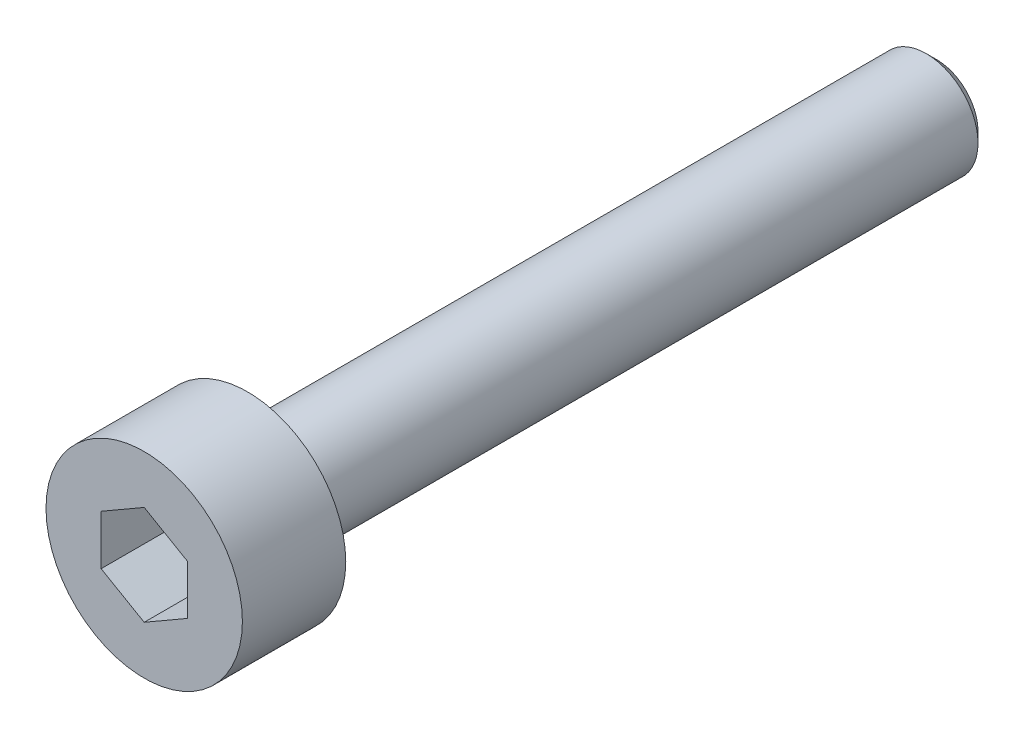
ISO-10303-21;
HEADER;
FILE_DESCRIPTION(('STEP AP214'),'2;1');
FILE_NAME('part.step','',(''),(''),'','','');
FILE_SCHEMA(('AUTOMOTIVE_DESIGN { 1 0 10303 214 1 1 1 1 }'));
ENDSEC;
DATA;
#1=APPLICATION_CONTEXT('core data for automotive mechanical design processes');
#2=APPLICATION_PROTOCOL_DEFINITION('international standard','automotive_design',2000,#1);
#3=PRODUCT_CONTEXT('',#1,'mechanical');
#4=PRODUCT('Part','Part','',(#3));
#5=PRODUCT_RELATED_PRODUCT_CATEGORY('part','',(#4));
#6=PRODUCT_DEFINITION_FORMATION('','',#4);
#7=PRODUCT_DEFINITION_CONTEXT('part definition',#1,'design');
#8=PRODUCT_DEFINITION('design','',#6,#7);
#9=PRODUCT_DEFINITION_SHAPE('','',#8);
#10=(LENGTH_UNIT() NAMED_UNIT(*) SI_UNIT(.MILLI.,.METRE.));
#11=(NAMED_UNIT(*) PLANE_ANGLE_UNIT() SI_UNIT($,.RADIAN.));
#12=(NAMED_UNIT(*) SI_UNIT($,.STERADIAN.) SOLID_ANGLE_UNIT());
#13=UNCERTAINTY_MEASURE_WITH_UNIT(LENGTH_MEASURE(1.E-05),#10,'distance_accuracy_value','');
#14=(GEOMETRIC_REPRESENTATION_CONTEXT(3) GLOBAL_UNCERTAINTY_ASSIGNED_CONTEXT((#13)) GLOBAL_UNIT_ASSIGNED_CONTEXT((#10,
#11,#12)) REPRESENTATION_CONTEXT('',''));
#15=CARTESIAN_POINT('',(0.,0.,0.));
#16=DIRECTION('',(0.,0.,1.));
#17=DIRECTION('',(1.,0.,0.));
#18=AXIS2_PLACEMENT_3D('',#15,#16,#17);
#19=CARTESIAN_POINT('',(0.,0.,0.));
#20=DIRECTION('',(0.,0.,1.));
#21=DIRECTION('',(1.,0.,0.));
#22=AXIS2_PLACEMENT_3D('',#19,#20,#21);
#23=PLANE('',#22);
#24=CARTESIAN_POINT('',(0.,0.,0.));
#25=DIRECTION('',(0.,0.,1.));
#26=DIRECTION('',(1.,0.,0.));
#27=AXIS2_PLACEMENT_3D('',#24,#25,#26);
#28=CIRCLE('',#27,2.85);
#29=CARTESIAN_POINT('',(2.85,0.,0.));
#30=VERTEX_POINT('',#29);
#31=EDGE_CURVE('E136',#30,#30,#28,.T.);
#32=ORIENTED_EDGE('',*,*,#31,.F.);
#33=EDGE_LOOP('',(#32));
#34=FACE_BOUND('',#33,.T.);
#35=CARTESIAN_POINT('',(0.,0.,0.));
#36=DIRECTION('',(0.,0.,1.));
#37=DIRECTION('',(1.,0.,0.));
#38=AXIS2_PLACEMENT_3D('',#35,#36,#37);
#39=CIRCLE('',#38,1.5);
#40=CARTESIAN_POINT('',(1.5,0.,0.));
#41=VERTEX_POINT('',#40);
#42=EDGE_CURVE('E145',#41,#41,#39,.F.);
#43=ORIENTED_EDGE('',*,*,#42,.F.);
#44=EDGE_LOOP('',(#43));
#45=FACE_BOUND('',#44,.T.);
#46=ADVANCED_FACE('F34',(#34,#45),#23,.F.);
#47=CARTESIAN_POINT('',(0.,0.,3.));
#48=DIRECTION('',(0.,0.,-1.));
#49=DIRECTION('',(-1.,0.,0.));
#50=AXIS2_PLACEMENT_3D('',#47,#48,#49);
#51=CYLINDRICAL_SURFACE('',#50,2.85);
#52=CARTESIAN_POINT('',(0.,0.,3.));
#53=DIRECTION('',(0.,0.,1.));
#54=DIRECTION('',(1.,0.,0.));
#55=AXIS2_PLACEMENT_3D('',#52,#53,#54);
#56=CIRCLE('',#55,2.85);
#57=CARTESIAN_POINT('',(2.85,0.,3.));
#58=VERTEX_POINT('',#57);
#59=EDGE_CURVE('E142',#58,#58,#56,.T.);
#60=ORIENTED_EDGE('',*,*,#59,.F.);
#61=EDGE_LOOP('',(#60));
#62=FACE_BOUND('',#61,.T.);
#63=ORIENTED_EDGE('',*,*,#31,.T.);
#64=EDGE_LOOP('',(#63));
#65=FACE_BOUND('',#64,.T.);
#66=ADVANCED_FACE('F167',(#62,#65),#51,.T.);
#67=CARTESIAN_POINT('',(0.,0.,3.));
#68=DIRECTION('',(0.,0.,1.));
#69=DIRECTION('',(1.,0.,0.));
#70=AXIS2_PLACEMENT_3D('',#67,#68,#69);
#71=PLANE('',#70);
#72=DIRECTION('',(-0.866025403784439,0.5,0.));
#73=VECTOR('',#72,1.);
#74=CARTESIAN_POINT('',(1.25,0.721687836487032,3.));
#75=LINE('',#74,#73);
#76=CARTESIAN_POINT('',(1.25,0.721687836487032,3.));
#77=VERTEX_POINT('',#76);
#78=CARTESIAN_POINT('',(0.,1.44337567297406,3.));
#79=VERTEX_POINT('',#78);
#80=EDGE_CURVE('E49',#77,#79,#75,.T.);
#81=ORIENTED_EDGE('',*,*,#80,.F.);
#82=DIRECTION('',(0.,1.,0.));
#83=VECTOR('',#82,1.);
#84=CARTESIAN_POINT('',(1.25,-0.721687836487032,3.));
#85=LINE('',#84,#83);
#86=CARTESIAN_POINT('',(1.25,-0.721687836487032,3.));
#87=VERTEX_POINT('',#86);
#88=EDGE_CURVE('E132',#87,#77,#85,.T.);
#89=ORIENTED_EDGE('',*,*,#88,.F.);
#90=DIRECTION('',(0.866025403784439,0.5,0.));
#91=VECTOR('',#90,1.);
#92=CARTESIAN_POINT('',(0.,-1.44337567297406,3.));
#93=LINE('',#92,#91);
#94=CARTESIAN_POINT('',(0.,-1.44337567297406,3.));
#95=VERTEX_POINT('',#94);
#96=EDGE_CURVE('E130',#95,#87,#93,.T.);
#97=ORIENTED_EDGE('',*,*,#96,.F.);
#98=DIRECTION('',(0.866025403784439,-0.5,0.));
#99=VECTOR('',#98,1.);
#100=CARTESIAN_POINT('',(-1.25,-0.721687836487033,3.));
#101=LINE('',#100,#99);
#102=CARTESIAN_POINT('',(-1.25,-0.721687836487033,3.));
#103=VERTEX_POINT('',#102);
#104=EDGE_CURVE('E97',#103,#95,#101,.T.);
#105=ORIENTED_EDGE('',*,*,#104,.F.);
#106=DIRECTION('',(0.,-1.,0.));
#107=VECTOR('',#106,1.);
#108=CARTESIAN_POINT('',(-1.25,0.721687836487032,3.));
#109=LINE('',#108,#107);
#110=CARTESIAN_POINT('',(-1.25,0.721687836487032,3.));
#111=VERTEX_POINT('',#110);
#112=EDGE_CURVE('E126',#111,#103,#109,.T.);
#113=ORIENTED_EDGE('',*,*,#112,.F.);
#114=DIRECTION('',(-0.866025403784439,-0.5,0.));
#115=VECTOR('',#114,1.);
#116=CARTESIAN_POINT('',(0.,1.44337567297406,3.));
#117=LINE('',#116,#115);
#118=EDGE_CURVE('E123',#79,#111,#117,.T.);
#119=ORIENTED_EDGE('',*,*,#118,.F.);
#120=EDGE_LOOP('',(#81,#89,#97,#105,#113,#119));
#121=FACE_BOUND('',#120,.T.);
#122=ORIENTED_EDGE('',*,*,#59,.T.);
#123=EDGE_LOOP('',(#122));
#124=FACE_BOUND('',#123,.T.);
#125=ADVANCED_FACE('F173',(#121,#124),#71,.T.);
#126=CARTESIAN_POINT('',(0.,0.,-20.));
#127=DIRECTION('',(0.,0.,1.));
#128=DIRECTION('',(1.,0.,0.));
#129=AXIS2_PLACEMENT_3D('',#126,#127,#128);
#130=CYLINDRICAL_SURFACE('',#129,1.5);
#131=CARTESIAN_POINT('',(0.,0.,-19.7));
#132=DIRECTION('',(0.,0.,-1.));
#133=DIRECTION('',(-1.,0.,0.));
#134=AXIS2_PLACEMENT_3D('',#131,#132,#133);
#135=CIRCLE('',#134,1.5);
#136=CARTESIAN_POINT('',(-1.5,0.,-19.7));
#137=VERTEX_POINT('',#136);
#138=EDGE_CURVE('E11',#137,#137,#135,.F.);
#139=ORIENTED_EDGE('',*,*,#138,.T.);
#140=EDGE_LOOP('',(#139));
#141=FACE_BOUND('',#140,.T.);
#142=ORIENTED_EDGE('',*,*,#42,.T.);
#143=EDGE_LOOP('',(#142));
#144=FACE_BOUND('',#143,.T.);
#145=ADVANCED_FACE('F163',(#141,#144),#130,.T.);
#146=CARTESIAN_POINT('',(0.,0.,-20.));
#147=DIRECTION('',(0.,0.,-1.));
#148=DIRECTION('',(-1.,0.,0.));
#149=AXIS2_PLACEMENT_3D('',#146,#147,#148);
#150=PLANE('',#149);
#151=CARTESIAN_POINT('',(0.,0.,-20.));
#152=DIRECTION('',(0.,0.,-1.));
#153=DIRECTION('',(-1.,0.,0.));
#154=AXIS2_PLACEMENT_3D('',#151,#152,#153);
#155=CIRCLE('',#154,1.2);
#156=CARTESIAN_POINT('',(-1.2,0.,-20.));
#157=VERTEX_POINT('',#156);
#158=EDGE_CURVE('E42',#157,#157,#155,.T.);
#159=ORIENTED_EDGE('',*,*,#158,.T.);
#160=EDGE_LOOP('',(#159));
#161=FACE_BOUND('',#160,.T.);
#162=ADVANCED_FACE('F152',(#161),#150,.T.);
#163=CARTESIAN_POINT('',(0.,0.,-20.));
#164=DIRECTION('',(0.,0.,1.));
#165=DIRECTION('',(1.,0.,0.));
#166=AXIS2_PLACEMENT_3D('',#163,#164,#165);
#167=CONICAL_SURFACE('',#166,1.2,0.785398163397447);
#168=ORIENTED_EDGE('',*,*,#138,.F.);
#169=EDGE_LOOP('',(#168));
#170=FACE_BOUND('',#169,.T.);
#171=ORIENTED_EDGE('',*,*,#158,.F.);
#172=EDGE_LOOP('',(#171));
#173=FACE_BOUND('',#172,.T.);
#174=ADVANCED_FACE('F36',(#170,#173),#167,.T.);
#175=CARTESIAN_POINT('',(1.25,0.721687836487032,1.));
#176=DIRECTION('',(0.5,0.866025403784439,0.));
#177=DIRECTION('',(-0.866025403784439,0.5,0.));
#178=AXIS2_PLACEMENT_3D('',#175,#176,#177);
#179=PLANE('',#178);
#180=ORIENTED_EDGE('',*,*,#80,.T.);
#181=DIRECTION('',(0.,0.,1.));
#182=VECTOR('',#181,1.);
#183=CARTESIAN_POINT('',(0.,1.44337567297406,1.));
#184=LINE('',#183,#182);
#185=CARTESIAN_POINT('',(0.,1.44337567297406,1.));
#186=VERTEX_POINT('',#185);
#187=EDGE_CURVE('E79',#186,#79,#184,.T.);
#188=ORIENTED_EDGE('',*,*,#187,.F.);
#189=DIRECTION('',(-0.866025403784439,0.5,0.));
#190=VECTOR('',#189,1.);
#191=CARTESIAN_POINT('',(1.25,0.721687836487032,1.));
#192=LINE('',#191,#190);
#193=CARTESIAN_POINT('',(1.25,0.721687836487032,1.));
#194=VERTEX_POINT('',#193);
#195=EDGE_CURVE('E134',#194,#186,#192,.T.);
#196=ORIENTED_EDGE('',*,*,#195,.F.);
#197=DIRECTION('',(0.,0.,1.));
#198=VECTOR('',#197,1.);
#199=CARTESIAN_POINT('',(1.25,0.721687836487032,1.));
#200=LINE('',#199,#198);
#201=EDGE_CURVE('E57',#194,#77,#200,.T.);
#202=ORIENTED_EDGE('',*,*,#201,.T.);
#203=EDGE_LOOP('',(#180,#188,#196,#202));
#204=FACE_BOUND('',#203,.T.);
#205=ADVANCED_FACE('F155',(#204),#179,.F.);
#206=CARTESIAN_POINT('',(1.25,-0.721687836487032,1.));
#207=DIRECTION('',(1.,0.,0.));
#208=DIRECTION('',(0.,1.,0.));
#209=AXIS2_PLACEMENT_3D('',#206,#207,#208);
#210=PLANE('',#209);
#211=ORIENTED_EDGE('',*,*,#88,.T.);
#212=ORIENTED_EDGE('',*,*,#201,.F.);
#213=DIRECTION('',(0.,1.,0.));
#214=VECTOR('',#213,1.);
#215=CARTESIAN_POINT('',(1.25,-0.721687836487032,1.));
#216=LINE('',#215,#214);
#217=CARTESIAN_POINT('',(1.25,-0.721687836487032,1.));
#218=VERTEX_POINT('',#217);
#219=EDGE_CURVE('E109',#218,#194,#216,.T.);
#220=ORIENTED_EDGE('',*,*,#219,.F.);
#221=DIRECTION('',(0.,0.,1.));
#222=VECTOR('',#221,1.);
#223=CARTESIAN_POINT('',(1.25,-0.721687836487032,1.));
#224=LINE('',#223,#222);
#225=EDGE_CURVE('E101',#218,#87,#224,.T.);
#226=ORIENTED_EDGE('',*,*,#225,.T.);
#227=EDGE_LOOP('',(#211,#212,#220,#226));
#228=FACE_BOUND('',#227,.T.);
#229=ADVANCED_FACE('F161',(#228),#210,.F.);
#230=CARTESIAN_POINT('',(0.,-1.44337567297406,1.));
#231=DIRECTION('',(0.5,-0.866025403784439,0.));
#232=DIRECTION('',(0.866025403784439,0.5,0.));
#233=AXIS2_PLACEMENT_3D('',#230,#231,#232);
#234=PLANE('',#233);
#235=ORIENTED_EDGE('',*,*,#96,.T.);
#236=ORIENTED_EDGE('',*,*,#225,.F.);
#237=DIRECTION('',(0.866025403784439,0.5,0.));
#238=VECTOR('',#237,1.);
#239=CARTESIAN_POINT('',(0.,-1.44337567297406,1.));
#240=LINE('',#239,#238);
#241=CARTESIAN_POINT('',(0.,-1.44337567297406,1.));
#242=VERTEX_POINT('',#241);
#243=EDGE_CURVE('E105',#242,#218,#240,.T.);
#244=ORIENTED_EDGE('',*,*,#243,.F.);
#245=DIRECTION('',(0.,0.,1.));
#246=VECTOR('',#245,1.);
#247=CARTESIAN_POINT('',(0.,-1.44337567297406,1.));
#248=LINE('',#247,#246);
#249=EDGE_CURVE('E90',#242,#95,#248,.T.);
#250=ORIENTED_EDGE('',*,*,#249,.T.);
#251=EDGE_LOOP('',(#235,#236,#244,#250));
#252=FACE_BOUND('',#251,.T.);
#253=ADVANCED_FACE('F106',(#252),#234,.F.);
#254=CARTESIAN_POINT('',(-1.25,-0.721687836487033,1.));
#255=DIRECTION('',(-0.5,-0.866025403784439,0.));
#256=DIRECTION('',(0.866025403784439,-0.5,0.));
#257=AXIS2_PLACEMENT_3D('',#254,#255,#256);
#258=PLANE('',#257);
#259=ORIENTED_EDGE('',*,*,#104,.T.);
#260=ORIENTED_EDGE('',*,*,#249,.F.);
#261=DIRECTION('',(0.866025403784439,-0.5,0.));
#262=VECTOR('',#261,1.);
#263=CARTESIAN_POINT('',(-1.25,-0.721687836487033,1.));
#264=LINE('',#263,#262);
#265=CARTESIAN_POINT('',(-1.25,-0.721687836487033,1.));
#266=VERTEX_POINT('',#265);
#267=EDGE_CURVE('E94',#266,#242,#264,.T.);
#268=ORIENTED_EDGE('',*,*,#267,.F.);
#269=DIRECTION('',(0.,0.,1.));
#270=VECTOR('',#269,1.);
#271=CARTESIAN_POINT('',(-1.25,-0.721687836487033,1.));
#272=LINE('',#271,#270);
#273=EDGE_CURVE('E102',#266,#103,#272,.T.);
#274=ORIENTED_EDGE('',*,*,#273,.T.);
#275=EDGE_LOOP('',(#259,#260,#268,#274));
#276=FACE_BOUND('',#275,.T.);
#277=ADVANCED_FACE('F92',(#276),#258,.F.);
#278=CARTESIAN_POINT('',(-1.25,0.721687836487032,1.));
#279=DIRECTION('',(-1.,0.,0.));
#280=DIRECTION('',(0.,0.,1.));
#281=AXIS2_PLACEMENT_3D('',#278,#279,#280);
#282=PLANE('',#281);
#283=ORIENTED_EDGE('',*,*,#112,.T.);
#284=ORIENTED_EDGE('',*,*,#273,.F.);
#285=DIRECTION('',(0.,-1.,0.));
#286=VECTOR('',#285,1.);
#287=CARTESIAN_POINT('',(-1.25,0.721687836487032,1.));
#288=LINE('',#287,#286);
#289=CARTESIAN_POINT('',(-1.25,0.721687836487032,1.));
#290=VERTEX_POINT('',#289);
#291=EDGE_CURVE('E115',#290,#266,#288,.T.);
#292=ORIENTED_EDGE('',*,*,#291,.F.);
#293=DIRECTION('',(0.,0.,1.));
#294=VECTOR('',#293,1.);
#295=CARTESIAN_POINT('',(-1.25,0.721687836487032,1.));
#296=LINE('',#295,#294);
#297=EDGE_CURVE('E139',#290,#111,#296,.T.);
#298=ORIENTED_EDGE('',*,*,#297,.T.);
#299=EDGE_LOOP('',(#283,#284,#292,#298));
#300=FACE_BOUND('',#299,.T.);
#301=ADVANCED_FACE('F187',(#300),#282,.F.);
#302=CARTESIAN_POINT('',(0.,1.44337567297406,1.));
#303=DIRECTION('',(-0.5,0.866025403784439,0.));
#304=DIRECTION('',(-0.866025403784439,-0.5,0.));
#305=AXIS2_PLACEMENT_3D('',#302,#303,#304);
#306=PLANE('',#305);
#307=ORIENTED_EDGE('',*,*,#118,.T.);
#308=ORIENTED_EDGE('',*,*,#297,.F.);
#309=DIRECTION('',(-0.866025403784439,-0.5,0.));
#310=VECTOR('',#309,1.);
#311=CARTESIAN_POINT('',(0.,1.44337567297406,1.));
#312=LINE('',#311,#310);
#313=EDGE_CURVE('E117',#186,#290,#312,.T.);
#314=ORIENTED_EDGE('',*,*,#313,.F.);
#315=ORIENTED_EDGE('',*,*,#187,.T.);
#316=EDGE_LOOP('',(#307,#308,#314,#315));
#317=FACE_BOUND('',#316,.T.);
#318=ADVANCED_FACE('F184',(#317),#306,.F.);
#319=CARTESIAN_POINT('',(0.,0.,1.));
#320=DIRECTION('',(0.,0.,1.));
#321=DIRECTION('',(1.,0.,0.));
#322=AXIS2_PLACEMENT_3D('',#319,#320,#321);
#323=PLANE('',#322);
#324=ORIENTED_EDGE('',*,*,#195,.T.);
#325=ORIENTED_EDGE('',*,*,#313,.T.);
#326=ORIENTED_EDGE('',*,*,#291,.T.);
#327=ORIENTED_EDGE('',*,*,#267,.T.);
#328=ORIENTED_EDGE('',*,*,#243,.T.);
#329=ORIENTED_EDGE('',*,*,#219,.T.);
#330=EDGE_LOOP('',(#324,#325,#326,#327,#328,#329));
#331=FACE_BOUND('',#330,.T.);
#332=ADVANCED_FACE('F112',(#331),#323,.T.);
#333=CLOSED_SHELL('',(#46,#66,#125,#145,#162,#174,#205,#229,#253,#277,#301,#318,#332));
#334=MANIFOLD_SOLID_BREP('B2',#333);
#335=ADVANCED_BREP_SHAPE_REPRESENTATION('',(#18,#334),#14);
#336=SHAPE_DEFINITION_REPRESENTATION(#9,#335);
ENDSEC;
END-ISO-10303-21;
